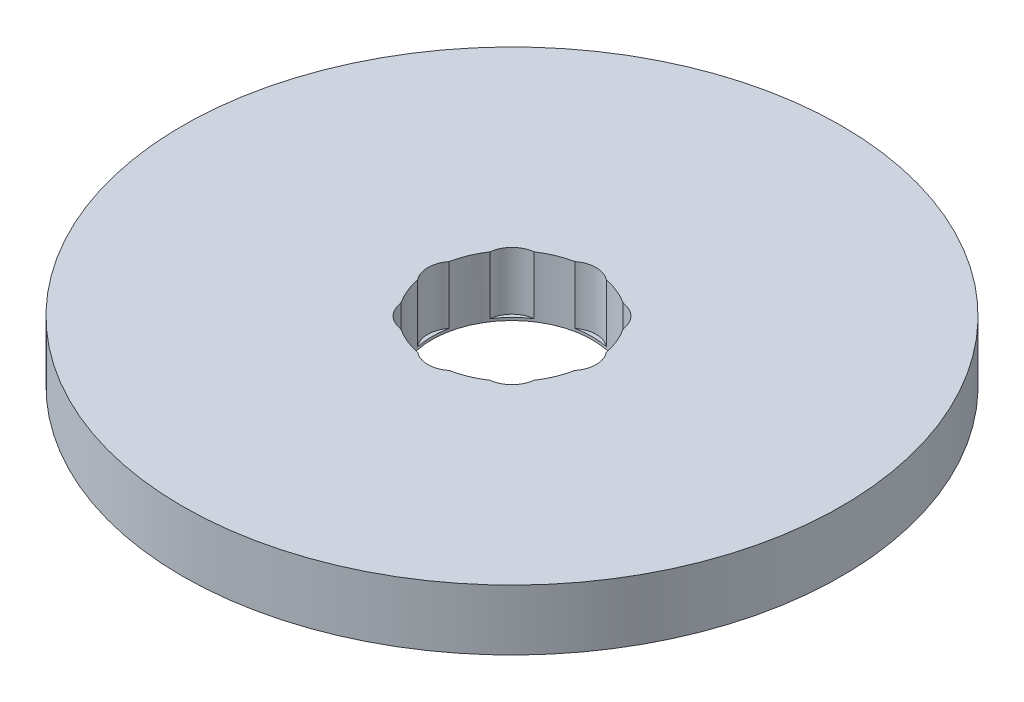
ISO-10303-21;
HEADER;
FILE_DESCRIPTION(('STEP AP214'),'2;1');
FILE_NAME('part.step','',(''),(''),'','','');
FILE_SCHEMA(('AUTOMOTIVE_DESIGN { 1 0 10303 214 1 1 1 1 }'));
ENDSEC;
DATA;
#1=APPLICATION_CONTEXT('core data for automotive mechanical design processes');
#2=APPLICATION_PROTOCOL_DEFINITION('international standard','automotive_design',2000,#1);
#3=PRODUCT_CONTEXT('',#1,'mechanical');
#4=PRODUCT('Part','Part','',(#3));
#5=PRODUCT_RELATED_PRODUCT_CATEGORY('part','',(#4));
#6=PRODUCT_DEFINITION_FORMATION('','',#4);
#7=PRODUCT_DEFINITION_CONTEXT('part definition',#1,'design');
#8=PRODUCT_DEFINITION('design','',#6,#7);
#9=PRODUCT_DEFINITION_SHAPE('','',#8);
#10=(LENGTH_UNIT() NAMED_UNIT(*) SI_UNIT(.MILLI.,.METRE.));
#11=(NAMED_UNIT(*) PLANE_ANGLE_UNIT() SI_UNIT($,.RADIAN.));
#12=(NAMED_UNIT(*) SI_UNIT($,.STERADIAN.) SOLID_ANGLE_UNIT());
#13=UNCERTAINTY_MEASURE_WITH_UNIT(LENGTH_MEASURE(1.E-05),#10,'distance_accuracy_value','');
#14=(GEOMETRIC_REPRESENTATION_CONTEXT(3) GLOBAL_UNCERTAINTY_ASSIGNED_CONTEXT((#13)) GLOBAL_UNIT_ASSIGNED_CONTEXT((#10,
#11,#12)) REPRESENTATION_CONTEXT('',''));
#15=CARTESIAN_POINT('',(0.,0.,0.));
#16=DIRECTION('',(0.,0.,1.));
#17=DIRECTION('',(1.,0.,0.));
#18=AXIS2_PLACEMENT_3D('',#15,#16,#17);
#19=CARTESIAN_POINT('',(0.,17.,0.));
#20=DIRECTION('',(0.,-1.,0.));
#21=DIRECTION('',(0.,0.,-1.));
#22=AXIS2_PLACEMENT_3D('',#19,#20,#21);
#23=CYLINDRICAL_SURFACE('',#22,92.5);
#24=CARTESIAN_POINT('',(0.,17.,0.));
#25=DIRECTION('',(0.,1.,0.));
#26=DIRECTION('',(0.,0.,1.));
#27=AXIS2_PLACEMENT_3D('',#24,#25,#26);
#28=CIRCLE('',#27,92.5);
#29=CARTESIAN_POINT('',(0.,17.,92.5));
#30=VERTEX_POINT('',#29);
#31=EDGE_CURVE('E263',#30,#30,#28,.T.);
#32=ORIENTED_EDGE('',*,*,#31,.F.);
#33=EDGE_LOOP('',(#32));
#34=FACE_BOUND('',#33,.T.);
#35=CARTESIAN_POINT('',(0.,0.,0.));
#36=DIRECTION('',(0.,1.,0.));
#37=DIRECTION('',(0.,0.,1.));
#38=AXIS2_PLACEMENT_3D('',#35,#36,#37);
#39=CIRCLE('',#38,92.5);
#40=CARTESIAN_POINT('',(0.,0.,92.5));
#41=VERTEX_POINT('',#40);
#42=EDGE_CURVE('E256',#41,#41,#39,.T.);
#43=ORIENTED_EDGE('',*,*,#42,.T.);
#44=EDGE_LOOP('',(#43));
#45=FACE_BOUND('',#44,.T.);
#46=ADVANCED_FACE('F39',(#34,#45),#23,.T.);
#47=CARTESIAN_POINT('',(0.,17.,0.));
#48=DIRECTION('',(0.,1.,0.));
#49=DIRECTION('',(0.,0.,1.));
#50=AXIS2_PLACEMENT_3D('',#47,#48,#49);
#51=PLANE('',#50);
#52=CARTESIAN_POINT('',(-11.6619322895249,17.,11.6619322895249));
#53=DIRECTION('',(0.,1.,0.));
#54=DIRECTION('',(0.707106781186549,0.,0.707106781186546));
#55=AXIS2_PLACEMENT_3D('',#52,#53,#54);
#56=CIRCLE('',#55,7.10537366992583);
#57=CARTESIAN_POINT('',(-18.7197222558963,17.,12.4828682065501));
#58=VERTEX_POINT('',#57);
#59=CARTESIAN_POINT('',(-12.48286820655,17.,18.7197222558964));
#60=VERTEX_POINT('',#59);
#61=EDGE_CURVE('E246',#58,#60,#56,.T.);
#62=ORIENTED_EDGE('',*,*,#61,.F.);
#63=CARTESIAN_POINT('',(0.,17.,0.));
#64=DIRECTION('',(0.,1.,0.));
#65=DIRECTION('',(0.,0.,1.));
#66=AXIS2_PLACEMENT_3D('',#63,#64,#65);
#67=CIRCLE('',#66,22.5);
#68=CARTESIAN_POINT('',(-22.0635633065826,17.,4.41012179156355));
#69=VERTEX_POINT('',#68);
#70=EDGE_CURVE('E254',#69,#58,#67,.T.);
#71=ORIENTED_EDGE('',*,*,#70,.F.);
#72=CARTESIAN_POINT('',(-16.4924628073229,17.,0.));
#73=DIRECTION('',(0.,1.,0.));
#74=DIRECTION('',(0.,0.,1.));
#75=AXIS2_PLACEMENT_3D('',#72,#73,#74);
#76=CIRCLE('',#75,7.10537366992583);
#77=CARTESIAN_POINT('',(-22.0635633065826,17.,-4.41012179156355));
#78=VERTEX_POINT('',#77);
#79=EDGE_CURVE('E248',#78,#69,#76,.T.);
#80=ORIENTED_EDGE('',*,*,#79,.F.);
#81=CARTESIAN_POINT('',(-18.7197222558965,17.,-12.4828682065498));
#82=VERTEX_POINT('',#81);
#83=EDGE_CURVE('E257',#82,#78,#67,.T.);
#84=ORIENTED_EDGE('',*,*,#83,.F.);
#85=CARTESIAN_POINT('',(-11.6619322895251,17.,-11.6619322895248));
#86=DIRECTION('',(0.,1.,0.));
#87=DIRECTION('',(-0.707106781186539,0.,0.707106781186556));
#88=AXIS2_PLACEMENT_3D('',#85,#86,#87);
#89=CIRCLE('',#88,7.10537366992583);
#90=CARTESIAN_POINT('',(-12.4828682065503,17.,-18.7197222558962));
#91=VERTEX_POINT('',#90);
#92=EDGE_CURVE('E58',#91,#82,#89,.T.);
#93=ORIENTED_EDGE('',*,*,#92,.F.);
#94=CARTESIAN_POINT('',(-4.41012179156378,17.,-22.0635633065825));
#95=VERTEX_POINT('',#94);
#96=EDGE_CURVE('E168',#95,#91,#67,.T.);
#97=ORIENTED_EDGE('',*,*,#96,.F.);
#98=CARTESIAN_POINT('',(-1.72749378369997E-13,17.,-16.4924628073229));
#99=DIRECTION('',(0.,1.,0.));
#100=DIRECTION('',(-1.,0.,0.));
#101=AXIS2_PLACEMENT_3D('',#98,#99,#100);
#102=CIRCLE('',#101,7.10537366992583);
#103=CARTESIAN_POINT('',(4.41012179156332,17.,-22.0635633065826));
#104=VERTEX_POINT('',#103);
#105=EDGE_CURVE('E165',#104,#95,#102,.T.);
#106=ORIENTED_EDGE('',*,*,#105,.F.);
#107=CARTESIAN_POINT('',(12.4828682065499,17.,-18.7197222558965));
#108=VERTEX_POINT('',#107);
#109=EDGE_CURVE('E604',#108,#104,#67,.T.);
#110=ORIENTED_EDGE('',*,*,#109,.F.);
#111=CARTESIAN_POINT('',(11.6619322895248,17.,-11.661932289525));
#112=DIRECTION('',(0.,1.,0.));
#113=DIRECTION('',(-0.707106781186554,0.,-0.707106781186541));
#114=AXIS2_PLACEMENT_3D('',#111,#112,#113);
#115=CIRCLE('',#114,7.10537366992583);
#116=CARTESIAN_POINT('',(18.7197222558963,17.,-12.4828682065502));
#117=VERTEX_POINT('',#116);
#118=EDGE_CURVE('E224',#117,#108,#115,.T.);
#119=ORIENTED_EDGE('',*,*,#118,.F.);
#120=CARTESIAN_POINT('',(22.0635633065826,17.,-4.41012179156354));
#121=VERTEX_POINT('',#120);
#122=EDGE_CURVE('E605',#121,#117,#67,.T.);
#123=ORIENTED_EDGE('',*,*,#122,.F.);
#124=CARTESIAN_POINT('',(16.4924628073229,17.,0.));
#125=DIRECTION('',(0.,1.,0.));
#126=DIRECTION('',(0.,0.,-1.));
#127=AXIS2_PLACEMENT_3D('',#124,#125,#126);
#128=CIRCLE('',#127,7.10537366992583);
#129=CARTESIAN_POINT('',(22.0635633065826,17.,4.41012179156355));
#130=VERTEX_POINT('',#129);
#131=EDGE_CURVE('E231',#130,#121,#128,.T.);
#132=ORIENTED_EDGE('',*,*,#131,.F.);
#133=CARTESIAN_POINT('',(18.7197222558964,17.,12.48286820655));
#134=VERTEX_POINT('',#133);
#135=EDGE_CURVE('E599',#134,#130,#67,.T.);
#136=ORIENTED_EDGE('',*,*,#135,.F.);
#137=CARTESIAN_POINT('',(11.661932289525,17.,11.6619322895249));
#138=DIRECTION('',(0.,1.,0.));
#139=DIRECTION('',(0.707106781186544,0.,-0.707106781186551));
#140=AXIS2_PLACEMENT_3D('',#137,#138,#139);
#141=CIRCLE('',#140,7.10537366992583);
#142=CARTESIAN_POINT('',(12.4828682065502,17.,18.7197222558963));
#143=VERTEX_POINT('',#142);
#144=EDGE_CURVE('E237',#143,#134,#141,.T.);
#145=ORIENTED_EDGE('',*,*,#144,.F.);
#146=CARTESIAN_POINT('',(4.41012179156362,17.,22.0635633065825));
#147=VERTEX_POINT('',#146);
#148=EDGE_CURVE('E598',#147,#143,#67,.T.);
#149=ORIENTED_EDGE('',*,*,#148,.F.);
#150=CARTESIAN_POINT('',(0.,17.,16.4924628073229));
#151=DIRECTION('',(0.,1.,0.));
#152=DIRECTION('',(1.,0.,0.));
#153=AXIS2_PLACEMENT_3D('',#150,#151,#152);
#154=CIRCLE('',#153,7.10537366992583);
#155=CARTESIAN_POINT('',(-4.41012179156347,17.,22.0635633065826));
#156=VERTEX_POINT('',#155);
#157=EDGE_CURVE('E241',#156,#147,#154,.T.);
#158=ORIENTED_EDGE('',*,*,#157,.F.);
#159=EDGE_CURVE('E259',#60,#156,#67,.T.);
#160=ORIENTED_EDGE('',*,*,#159,.F.);
#161=EDGE_LOOP('',(#62,#71,#80,#84,#93,#97,#106,#110,#119,#123,#132,#136,#145,#149,#158,#160));
#162=FACE_BOUND('',#161,.T.);
#163=ORIENTED_EDGE('',*,*,#31,.T.);
#164=EDGE_LOOP('',(#163));
#165=FACE_BOUND('',#164,.T.);
#166=ADVANCED_FACE('F286',(#162,#165),#51,.T.);
#167=CARTESIAN_POINT('',(0.,0.,0.));
#168=DIRECTION('',(0.,1.,0.));
#169=DIRECTION('',(0.,0.,1.));
#170=AXIS2_PLACEMENT_3D('',#167,#168,#169);
#171=PLANE('',#170);
#172=CARTESIAN_POINT('',(0.,0.,0.));
#173=DIRECTION('',(0.,1.,0.));
#174=DIRECTION('',(0.,0.,1.));
#175=AXIS2_PLACEMENT_3D('',#172,#173,#174);
#176=CIRCLE('',#175,22.5);
#177=CARTESIAN_POINT('',(0.,0.,22.5));
#178=VERTEX_POINT('',#177);
#179=EDGE_CURVE('E251',#178,#178,#176,.T.);
#180=ORIENTED_EDGE('',*,*,#179,.T.);
#181=EDGE_LOOP('',(#180));
#182=FACE_BOUND('',#181,.T.);
#183=ORIENTED_EDGE('',*,*,#42,.F.);
#184=EDGE_LOOP('',(#183));
#185=FACE_BOUND('',#184,.T.);
#186=ADVANCED_FACE('F308',(#182,#185),#171,.F.);
#187=CARTESIAN_POINT('',(0.,17.,0.));
#188=DIRECTION('',(0.,-1.,0.));
#189=DIRECTION('',(0.,0.,-1.));
#190=AXIS2_PLACEMENT_3D('',#187,#188,#189);
#191=CYLINDRICAL_SURFACE('',#190,22.5);
#192=DIRECTION('',(0.,1.,0.));
#193=VECTOR('',#192,1.);
#194=CARTESIAN_POINT('',(-18.7197222558963,8.87853621372435,12.4828682065501));
#195=LINE('',#194,#193);
#196=CARTESIAN_POINT('',(-18.7197222558963,0.757072427448699,12.4828682065501));
#197=VERTEX_POINT('',#196);
#198=EDGE_CURVE('E11',#197,#58,#195,.T.);
#199=ORIENTED_EDGE('',*,*,#198,.F.);
#200=CARTESIAN_POINT('',(0.,0.757072427448699,0.));
#201=DIRECTION('',(0.,1.,0.));
#202=DIRECTION('',(0.,0.,1.));
#203=AXIS2_PLACEMENT_3D('',#200,#201,#202);
#204=CIRCLE('',#203,22.5);
#205=CARTESIAN_POINT('',(-12.48286820655,0.757072427448699,18.7197222558964));
#206=VERTEX_POINT('',#205);
#207=EDGE_CURVE('E157',#197,#206,#204,.T.);
#208=ORIENTED_EDGE('',*,*,#207,.T.);
#209=DIRECTION('',(0.,1.,0.));
#210=VECTOR('',#209,1.);
#211=CARTESIAN_POINT('',(-12.48286820655,8.87853621372435,18.7197222558964));
#212=LINE('',#211,#210);
#213=EDGE_CURVE('E46',#60,#206,#212,.F.);
#214=ORIENTED_EDGE('',*,*,#213,.F.);
#215=ORIENTED_EDGE('',*,*,#159,.T.);
#216=DIRECTION('',(0.,1.,0.));
#217=VECTOR('',#216,1.);
#218=CARTESIAN_POINT('',(-4.41012179156347,8.87853621372435,22.0635633065826));
#219=LINE('',#218,#217);
#220=CARTESIAN_POINT('',(-4.41012179156347,0.757072427448699,22.0635633065826));
#221=VERTEX_POINT('',#220);
#222=EDGE_CURVE('E198',#221,#156,#219,.T.);
#223=ORIENTED_EDGE('',*,*,#222,.F.);
#224=CARTESIAN_POINT('',(4.41012179156362,0.757072427448699,22.0635633065826));
#225=VERTEX_POINT('',#224);
#226=EDGE_CURVE('E194',#221,#225,#204,.T.);
#227=ORIENTED_EDGE('',*,*,#226,.T.);
#228=DIRECTION('',(0.,1.,0.));
#229=VECTOR('',#228,1.);
#230=CARTESIAN_POINT('',(4.41012179156362,8.87853621372435,22.0635633065826));
#231=LINE('',#230,#229);
#232=EDGE_CURVE('E192',#147,#225,#231,.F.);
#233=ORIENTED_EDGE('',*,*,#232,.F.);
#234=ORIENTED_EDGE('',*,*,#148,.T.);
#235=DIRECTION('',(0.,1.,0.));
#236=VECTOR('',#235,1.);
#237=CARTESIAN_POINT('',(12.4828682065502,8.87853621372435,18.7197222558963));
#238=LINE('',#237,#236);
#239=CARTESIAN_POINT('',(12.4828682065502,0.757072427448699,18.7197222558963));
#240=VERTEX_POINT('',#239);
#241=EDGE_CURVE('E191',#240,#143,#238,.T.);
#242=ORIENTED_EDGE('',*,*,#241,.F.);
#243=CARTESIAN_POINT('',(18.7197222558964,0.757072427448699,12.48286820655));
#244=VERTEX_POINT('',#243);
#245=EDGE_CURVE('E189',#240,#244,#204,.T.);
#246=ORIENTED_EDGE('',*,*,#245,.T.);
#247=DIRECTION('',(0.,1.,0.));
#248=VECTOR('',#247,1.);
#249=CARTESIAN_POINT('',(18.7197222558964,8.87853621372435,12.48286820655));
#250=LINE('',#249,#248);
#251=EDGE_CURVE('E187',#134,#244,#250,.F.);
#252=ORIENTED_EDGE('',*,*,#251,.F.);
#253=ORIENTED_EDGE('',*,*,#135,.T.);
#254=DIRECTION('',(0.,1.,0.));
#255=VECTOR('',#254,1.);
#256=CARTESIAN_POINT('',(22.0635633065826,8.87853621372435,4.41012179156355));
#257=LINE('',#256,#255);
#258=CARTESIAN_POINT('',(22.0635633065826,0.757072427448699,4.41012179156355));
#259=VERTEX_POINT('',#258);
#260=EDGE_CURVE('E186',#259,#130,#257,.T.);
#261=ORIENTED_EDGE('',*,*,#260,.F.);
#262=CARTESIAN_POINT('',(22.0635633065826,0.757072427448699,-4.41012179156355));
#263=VERTEX_POINT('',#262);
#264=EDGE_CURVE('E183',#259,#263,#204,.T.);
#265=ORIENTED_EDGE('',*,*,#264,.T.);
#266=DIRECTION('',(0.,1.,0.));
#267=VECTOR('',#266,1.);
#268=CARTESIAN_POINT('',(22.0635633065826,8.87853621372435,-4.41012179156355));
#269=LINE('',#268,#267);
#270=EDGE_CURVE('E181',#121,#263,#269,.F.);
#271=ORIENTED_EDGE('',*,*,#270,.F.);
#272=ORIENTED_EDGE('',*,*,#122,.T.);
#273=DIRECTION('',(0.,1.,0.));
#274=VECTOR('',#273,1.);
#275=CARTESIAN_POINT('',(18.7197222558963,8.87853621372435,-12.4828682065502));
#276=LINE('',#275,#274);
#277=CARTESIAN_POINT('',(18.7197222558963,0.757072427448699,-12.4828682065502));
#278=VERTEX_POINT('',#277);
#279=EDGE_CURVE('E182',#278,#117,#276,.T.);
#280=ORIENTED_EDGE('',*,*,#279,.F.);
#281=CARTESIAN_POINT('',(12.4828682065499,0.757072427448699,-18.7197222558965));
#282=VERTEX_POINT('',#281);
#283=EDGE_CURVE('E179',#278,#282,#204,.T.);
#284=ORIENTED_EDGE('',*,*,#283,.T.);
#285=DIRECTION('',(0.,1.,0.));
#286=VECTOR('',#285,1.);
#287=CARTESIAN_POINT('',(12.4828682065499,8.87853621372435,-18.7197222558965));
#288=LINE('',#287,#286);
#289=EDGE_CURVE('E177',#108,#282,#288,.F.);
#290=ORIENTED_EDGE('',*,*,#289,.F.);
#291=ORIENTED_EDGE('',*,*,#109,.T.);
#292=DIRECTION('',(0.,1.,0.));
#293=VECTOR('',#292,1.);
#294=CARTESIAN_POINT('',(4.41012179156332,8.87853621372435,-22.0635633065826));
#295=LINE('',#294,#293);
#296=CARTESIAN_POINT('',(4.41012179156332,0.757072427448699,-22.0635633065826));
#297=VERTEX_POINT('',#296);
#298=EDGE_CURVE('E176',#297,#104,#295,.T.);
#299=ORIENTED_EDGE('',*,*,#298,.F.);
#300=CARTESIAN_POINT('',(-4.41012179156378,0.757072427448699,-22.0635633065825));
#301=VERTEX_POINT('',#300);
#302=EDGE_CURVE('E159',#297,#301,#204,.T.);
#303=ORIENTED_EDGE('',*,*,#302,.T.);
#304=DIRECTION('',(0.,1.,0.));
#305=VECTOR('',#304,1.);
#306=CARTESIAN_POINT('',(-4.41012179156378,8.87853621372435,-22.0635633065825));
#307=LINE('',#306,#305);
#308=EDGE_CURVE('E171',#95,#301,#307,.F.);
#309=ORIENTED_EDGE('',*,*,#308,.F.);
#310=ORIENTED_EDGE('',*,*,#96,.T.);
#311=DIRECTION('',(0.,1.,0.));
#312=VECTOR('',#311,1.);
#313=CARTESIAN_POINT('',(-12.4828682065503,8.87853621372435,-18.7197222558962));
#314=LINE('',#313,#312);
#315=CARTESIAN_POINT('',(-12.4828682065503,0.757072427448699,-18.7197222558962));
#316=VERTEX_POINT('',#315);
#317=EDGE_CURVE('E156',#316,#91,#314,.T.);
#318=ORIENTED_EDGE('',*,*,#317,.F.);
#319=CARTESIAN_POINT('',(-18.7197222558965,0.757072427448699,-12.4828682065498));
#320=VERTEX_POINT('',#319);
#321=EDGE_CURVE('E147',#316,#320,#204,.T.);
#322=ORIENTED_EDGE('',*,*,#321,.T.);
#323=DIRECTION('',(0.,1.,0.));
#324=VECTOR('',#323,1.);
#325=CARTESIAN_POINT('',(-18.7197222558965,8.87853621372435,-12.4828682065498));
#326=LINE('',#325,#324);
#327=EDGE_CURVE('E160',#82,#320,#326,.F.);
#328=ORIENTED_EDGE('',*,*,#327,.F.);
#329=ORIENTED_EDGE('',*,*,#83,.T.);
#330=DIRECTION('',(0.,1.,0.));
#331=VECTOR('',#330,1.);
#332=CARTESIAN_POINT('',(-22.0635633065826,8.87853621372435,-4.41012179156355));
#333=LINE('',#332,#331);
#334=CARTESIAN_POINT('',(-22.0635633065826,0.757072427448699,-4.41012179156355));
#335=VERTEX_POINT('',#334);
#336=EDGE_CURVE('E273',#335,#78,#333,.T.);
#337=ORIENTED_EDGE('',*,*,#336,.F.);
#338=CARTESIAN_POINT('',(0.,0.757072427448699,0.));
#339=DIRECTION('',(0.,1.,0.));
#340=DIRECTION('',(0.,0.,1.));
#341=AXIS2_PLACEMENT_3D('',#338,#339,#340);
#342=CIRCLE('',#341,22.5);
#343=CARTESIAN_POINT('',(-22.0635633065826,0.757072427448699,4.41012179156355));
#344=VERTEX_POINT('',#343);
#345=EDGE_CURVE('E266',#335,#344,#342,.T.);
#346=ORIENTED_EDGE('',*,*,#345,.T.);
#347=DIRECTION('',(0.,1.,0.));
#348=VECTOR('',#347,1.);
#349=CARTESIAN_POINT('',(-22.0635633065826,8.87853621372435,4.41012179156355));
#350=LINE('',#349,#348);
#351=EDGE_CURVE('E271',#69,#344,#350,.F.);
#352=ORIENTED_EDGE('',*,*,#351,.F.);
#353=ORIENTED_EDGE('',*,*,#70,.T.);
#354=EDGE_LOOP('',(#199,#208,#214,#215,#223,#227,#233,#234,#242,#246,#252,#253,#261,#265,#271,
#272,#280,#284,#290,#291,#299,#303,#309,#310,#318,#322,#328,#329,#337,#346,#352,#353));
#355=FACE_BOUND('',#354,.T.);
#356=ORIENTED_EDGE('',*,*,#179,.F.);
#357=EDGE_LOOP('',(#356));
#358=FACE_BOUND('',#357,.T.);
#359=ADVANCED_FACE('F167',(#355,#358),#191,.F.);
#360=CARTESIAN_POINT('',(-16.4924628073229,0.757072427448699,0.));
#361=DIRECTION('',(0.,1.,0.));
#362=DIRECTION('',(0.,0.,1.));
#363=AXIS2_PLACEMENT_3D('',#360,#361,#362);
#364=CYLINDRICAL_SURFACE('',#363,7.10537366992583);
#365=ORIENTED_EDGE('',*,*,#336,.T.);
#366=ORIENTED_EDGE('',*,*,#79,.T.);
#367=ORIENTED_EDGE('',*,*,#351,.T.);
#368=CARTESIAN_POINT('',(-16.4924628073229,0.757072427448699,0.));
#369=DIRECTION('',(0.,1.,0.));
#370=DIRECTION('',(0.,0.,1.));
#371=AXIS2_PLACEMENT_3D('',#368,#369,#370);
#372=CIRCLE('',#371,7.10537366992583);
#373=EDGE_CURVE('E253',#335,#344,#372,.T.);
#374=ORIENTED_EDGE('',*,*,#373,.F.);
#375=EDGE_LOOP('',(#365,#366,#367,#374));
#376=FACE_BOUND('',#375,.T.);
#377=ADVANCED_FACE('F278',(#376),#364,.F.);
#378=CARTESIAN_POINT('',(-16.4924628073229,0.757072427448699,0.));
#379=DIRECTION('',(0.,1.,0.));
#380=DIRECTION('',(0.,0.,1.));
#381=AXIS2_PLACEMENT_3D('',#378,#379,#380);
#382=PLANE('',#381);
#383=ORIENTED_EDGE('',*,*,#373,.T.);
#384=ORIENTED_EDGE('',*,*,#345,.F.);
#385=EDGE_LOOP('',(#383,#384));
#386=FACE_BOUND('',#385,.T.);
#387=ADVANCED_FACE('F289',(#386),#382,.T.);
#388=CARTESIAN_POINT('',(-11.6619322895251,0.757072427448699,-11.6619322895248));
#389=DIRECTION('',(0.,1.,0.));
#390=DIRECTION('',(0.,0.,1.));
#391=AXIS2_PLACEMENT_3D('',#388,#389,#390);
#392=CYLINDRICAL_SURFACE('',#391,7.10537366992583);
#393=ORIENTED_EDGE('',*,*,#317,.T.);
#394=ORIENTED_EDGE('',*,*,#92,.T.);
#395=ORIENTED_EDGE('',*,*,#327,.T.);
#396=CARTESIAN_POINT('',(-11.6619322895251,0.757072427448699,-11.6619322895248));
#397=DIRECTION('',(0.,1.,0.));
#398=DIRECTION('',(-0.707106781186539,0.,0.707106781186556));
#399=AXIS2_PLACEMENT_3D('',#396,#397,#398);
#400=CIRCLE('',#399,7.10537366992583);
#401=EDGE_CURVE('E153',#316,#320,#400,.T.);
#402=ORIENTED_EDGE('',*,*,#401,.F.);
#403=EDGE_LOOP('',(#393,#394,#395,#402));
#404=FACE_BOUND('',#403,.T.);
#405=ADVANCED_FACE('F161',(#404),#392,.F.);
#406=CARTESIAN_POINT('',(-11.6619322895249,0.757072427448699,11.6619322895249));
#407=DIRECTION('',(0.,1.,0.));
#408=DIRECTION('',(0.707106781186549,0.,0.707106781186546));
#409=AXIS2_PLACEMENT_3D('',#406,#407,#408);
#410=PLANE('',#409);
#411=ORIENTED_EDGE('',*,*,#401,.T.);
#412=ORIENTED_EDGE('',*,*,#321,.F.);
#413=EDGE_LOOP('',(#411,#412));
#414=FACE_BOUND('',#413,.T.);
#415=ADVANCED_FACE('F155',(#414),#410,.T.);
#416=CARTESIAN_POINT('',(-1.72749378369997E-13,0.757072427448699,-16.4924628073229));
#417=DIRECTION('',(0.,1.,0.));
#418=DIRECTION('',(0.,0.,1.));
#419=AXIS2_PLACEMENT_3D('',#416,#417,#418);
#420=CYLINDRICAL_SURFACE('',#419,7.10537366992583);
#421=ORIENTED_EDGE('',*,*,#298,.T.);
#422=ORIENTED_EDGE('',*,*,#105,.T.);
#423=ORIENTED_EDGE('',*,*,#308,.T.);
#424=CARTESIAN_POINT('',(-1.72749378369997E-13,0.757072427448699,-16.4924628073229));
#425=DIRECTION('',(0.,1.,0.));
#426=DIRECTION('',(-1.,0.,0.));
#427=AXIS2_PLACEMENT_3D('',#424,#425,#426);
#428=CIRCLE('',#427,7.10537366992583);
#429=EDGE_CURVE('E218',#297,#301,#428,.T.);
#430=ORIENTED_EDGE('',*,*,#429,.F.);
#431=EDGE_LOOP('',(#421,#422,#423,#430));
#432=FACE_BOUND('',#431,.T.);
#433=ADVANCED_FACE('F222',(#432),#420,.F.);
#434=ORIENTED_EDGE('',*,*,#429,.T.);
#435=ORIENTED_EDGE('',*,*,#302,.F.);
#436=EDGE_LOOP('',(#434,#435));
#437=FACE_BOUND('',#436,.T.);
#438=ADVANCED_FACE('F217',(#437),#410,.T.);
#439=CARTESIAN_POINT('',(11.6619322895248,0.757072427448699,-11.661932289525));
#440=DIRECTION('',(0.,1.,0.));
#441=DIRECTION('',(0.,0.,1.));
#442=AXIS2_PLACEMENT_3D('',#439,#440,#441);
#443=CYLINDRICAL_SURFACE('',#442,7.10537366992583);
#444=ORIENTED_EDGE('',*,*,#279,.T.);
#445=ORIENTED_EDGE('',*,*,#118,.T.);
#446=ORIENTED_EDGE('',*,*,#289,.T.);
#447=CARTESIAN_POINT('',(11.6619322895248,0.757072427448699,-11.661932289525));
#448=DIRECTION('',(0.,1.,0.));
#449=DIRECTION('',(-0.707106781186554,0.,-0.707106781186541));
#450=AXIS2_PLACEMENT_3D('',#447,#448,#449);
#451=CIRCLE('',#450,7.10537366992583);
#452=EDGE_CURVE('E223',#278,#282,#451,.T.);
#453=ORIENTED_EDGE('',*,*,#452,.F.);
#454=EDGE_LOOP('',(#444,#445,#446,#453));
#455=FACE_BOUND('',#454,.T.);
#456=ADVANCED_FACE('F355',(#455),#443,.F.);
#457=ORIENTED_EDGE('',*,*,#452,.T.);
#458=ORIENTED_EDGE('',*,*,#283,.F.);
#459=EDGE_LOOP('',(#457,#458));
#460=FACE_BOUND('',#459,.T.);
#461=ADVANCED_FACE('F352',(#460),#410,.T.);
#462=CARTESIAN_POINT('',(16.4924628073229,0.757072427448699,0.));
#463=DIRECTION('',(0.,1.,0.));
#464=DIRECTION('',(0.,0.,1.));
#465=AXIS2_PLACEMENT_3D('',#462,#463,#464);
#466=CYLINDRICAL_SURFACE('',#465,7.10537366992583);
#467=ORIENTED_EDGE('',*,*,#260,.T.);
#468=ORIENTED_EDGE('',*,*,#131,.T.);
#469=ORIENTED_EDGE('',*,*,#270,.T.);
#470=CARTESIAN_POINT('',(16.4924628073229,0.757072427448699,0.));
#471=DIRECTION('',(0.,1.,0.));
#472=DIRECTION('',(0.,0.,-1.));
#473=AXIS2_PLACEMENT_3D('',#470,#471,#472);
#474=CIRCLE('',#473,7.10537366992583);
#475=EDGE_CURVE('E232',#259,#263,#474,.T.);
#476=ORIENTED_EDGE('',*,*,#475,.F.);
#477=EDGE_LOOP('',(#467,#468,#469,#476));
#478=FACE_BOUND('',#477,.T.);
#479=ADVANCED_FACE('F369',(#478),#466,.F.);
#480=ORIENTED_EDGE('',*,*,#475,.T.);
#481=ORIENTED_EDGE('',*,*,#264,.F.);
#482=EDGE_LOOP('',(#480,#481));
#483=FACE_BOUND('',#482,.T.);
#484=ADVANCED_FACE('F371',(#483),#410,.T.);
#485=CARTESIAN_POINT('',(11.661932289525,0.757072427448699,11.6619322895249));
#486=DIRECTION('',(0.,1.,0.));
#487=DIRECTION('',(0.,0.,1.));
#488=AXIS2_PLACEMENT_3D('',#485,#486,#487);
#489=CYLINDRICAL_SURFACE('',#488,7.10537366992583);
#490=ORIENTED_EDGE('',*,*,#241,.T.);
#491=ORIENTED_EDGE('',*,*,#144,.T.);
#492=ORIENTED_EDGE('',*,*,#251,.T.);
#493=CARTESIAN_POINT('',(11.661932289525,0.757072427448699,11.6619322895249));
#494=DIRECTION('',(0.,1.,0.));
#495=DIRECTION('',(0.707106781186544,0.,-0.707106781186551));
#496=AXIS2_PLACEMENT_3D('',#493,#494,#495);
#497=CIRCLE('',#496,7.10537366992583);
#498=EDGE_CURVE('E236',#240,#244,#497,.T.);
#499=ORIENTED_EDGE('',*,*,#498,.F.);
#500=EDGE_LOOP('',(#490,#491,#492,#499));
#501=FACE_BOUND('',#500,.T.);
#502=ADVANCED_FACE('F390',(#501),#489,.F.);
#503=ORIENTED_EDGE('',*,*,#498,.T.);
#504=ORIENTED_EDGE('',*,*,#245,.F.);
#505=EDGE_LOOP('',(#503,#504));
#506=FACE_BOUND('',#505,.T.);
#507=ADVANCED_FACE('F386',(#506),#410,.T.);
#508=CARTESIAN_POINT('',(0.,0.757072427448699,16.4924628073229));
#509=DIRECTION('',(0.,1.,0.));
#510=DIRECTION('',(0.,0.,1.));
#511=AXIS2_PLACEMENT_3D('',#508,#509,#510);
#512=CYLINDRICAL_SURFACE('',#511,7.10537366992583);
#513=ORIENTED_EDGE('',*,*,#222,.T.);
#514=ORIENTED_EDGE('',*,*,#157,.T.);
#515=ORIENTED_EDGE('',*,*,#232,.T.);
#516=CARTESIAN_POINT('',(0.,0.757072427448699,16.4924628073229));
#517=DIRECTION('',(0.,1.,0.));
#518=DIRECTION('',(1.,0.,0.));
#519=AXIS2_PLACEMENT_3D('',#516,#517,#518);
#520=CIRCLE('',#519,7.10537366992583);
#521=EDGE_CURVE('E242',#221,#225,#520,.T.);
#522=ORIENTED_EDGE('',*,*,#521,.F.);
#523=EDGE_LOOP('',(#513,#514,#515,#522));
#524=FACE_BOUND('',#523,.T.);
#525=ADVANCED_FACE('F403',(#524),#512,.F.);
#526=ORIENTED_EDGE('',*,*,#521,.T.);
#527=ORIENTED_EDGE('',*,*,#226,.F.);
#528=EDGE_LOOP('',(#526,#527));
#529=FACE_BOUND('',#528,.T.);
#530=ADVANCED_FACE('F410',(#529),#410,.T.);
#531=CARTESIAN_POINT('',(-11.6619322895249,0.757072427448699,11.6619322895249));
#532=DIRECTION('',(0.,1.,0.));
#533=DIRECTION('',(0.707106781186549,0.,0.707106781186546));
#534=AXIS2_PLACEMENT_3D('',#531,#532,#533);
#535=CIRCLE('',#534,7.10537366992583);
#536=EDGE_CURVE('E55',#197,#206,#535,.T.);
#537=ORIENTED_EDGE('',*,*,#536,.T.);
#538=ORIENTED_EDGE('',*,*,#207,.F.);
#539=EDGE_LOOP('',(#537,#538));
#540=FACE_BOUND('',#539,.T.);
#541=ADVANCED_FACE('F340',(#540),#410,.T.);
#542=CARTESIAN_POINT('',(-11.6619322895249,0.757072427448699,11.6619322895249));
#543=DIRECTION('',(0.,1.,0.));
#544=DIRECTION('',(0.,0.,1.));
#545=AXIS2_PLACEMENT_3D('',#542,#543,#544);
#546=CYLINDRICAL_SURFACE('',#545,7.10537366992583);
#547=ORIENTED_EDGE('',*,*,#198,.T.);
#548=ORIENTED_EDGE('',*,*,#61,.T.);
#549=ORIENTED_EDGE('',*,*,#213,.T.);
#550=ORIENTED_EDGE('',*,*,#536,.F.);
#551=EDGE_LOOP('',(#547,#548,#549,#550));
#552=FACE_BOUND('',#551,.T.);
#553=ADVANCED_FACE('F431',(#552),#546,.F.);
#554=CLOSED_SHELL('',(#46,#166,#186,#359,#377,#387,#405,#415,#433,#438,#456,#461,#479,#484,#502,
#507,#525,#530,#541,#553));
#555=MANIFOLD_SOLID_BREP('B2',#554);
#556=ADVANCED_BREP_SHAPE_REPRESENTATION('',(#18,#555),#14);
#557=SHAPE_DEFINITION_REPRESENTATION(#9,#556);
ENDSEC;
END-ISO-10303-21;
